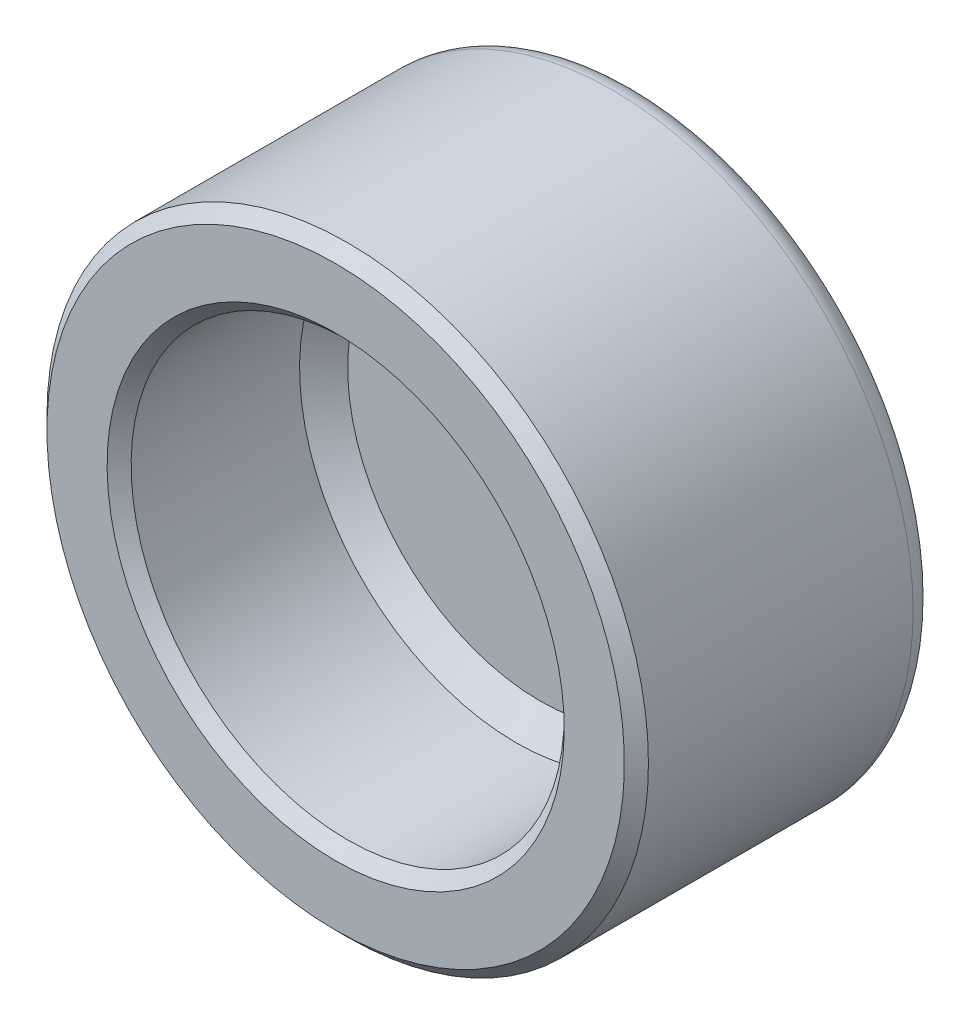
ISO-10303-21;
HEADER;
FILE_DESCRIPTION(('STEP AP214'),'2;1');
FILE_NAME('part.step','',(''),(''),'','','');
FILE_SCHEMA(('AUTOMOTIVE_DESIGN { 1 0 10303 214 1 1 1 1 }'));
ENDSEC;
DATA;
#1=APPLICATION_CONTEXT('core data for automotive mechanical design processes');
#2=APPLICATION_PROTOCOL_DEFINITION('international standard','automotive_design',2000,#1);
#3=PRODUCT_CONTEXT('',#1,'mechanical');
#4=PRODUCT('Part','Part','',(#3));
#5=PRODUCT_RELATED_PRODUCT_CATEGORY('part','',(#4));
#6=PRODUCT_DEFINITION_FORMATION('','',#4);
#7=PRODUCT_DEFINITION_CONTEXT('part definition',#1,'design');
#8=PRODUCT_DEFINITION('design','',#6,#7);
#9=PRODUCT_DEFINITION_SHAPE('','',#8);
#10=(LENGTH_UNIT() NAMED_UNIT(*) SI_UNIT(.MILLI.,.METRE.));
#11=(NAMED_UNIT(*) PLANE_ANGLE_UNIT() SI_UNIT($,.RADIAN.));
#12=(NAMED_UNIT(*) SI_UNIT($,.STERADIAN.) SOLID_ANGLE_UNIT());
#13=UNCERTAINTY_MEASURE_WITH_UNIT(LENGTH_MEASURE(1.E-05),#10,'distance_accuracy_value','');
#14=(GEOMETRIC_REPRESENTATION_CONTEXT(3) GLOBAL_UNCERTAINTY_ASSIGNED_CONTEXT((#13)) GLOBAL_UNIT_ASSIGNED_CONTEXT((#10,
#11,#12)) REPRESENTATION_CONTEXT('',''));
#15=CARTESIAN_POINT('',(0.,0.,0.));
#16=DIRECTION('',(0.,0.,1.));
#17=DIRECTION('',(1.,0.,0.));
#18=AXIS2_PLACEMENT_3D('',#15,#16,#17);
#19=CARTESIAN_POINT('',(100.,100.,1.50000000000002));
#20=DIRECTION('',(0.,0.,-1.));
#21=DIRECTION('',(0.,-1.,0.));
#22=AXIS2_PLACEMENT_3D('',#19,#20,#21);
#23=TOROIDAL_SURFACE('',#22,11.5,1.00000000000002);
#24=CARTESIAN_POINT('',(100.,100.,0.5));
#25=DIRECTION('',(0.,0.,1.));
#26=DIRECTION('',(1.,0.,0.));
#27=AXIS2_PLACEMENT_3D('',#24,#25,#26);
#28=CIRCLE('',#27,11.5);
#29=CARTESIAN_POINT('',(111.5,100.,0.5));
#30=VERTEX_POINT('',#29);
#31=EDGE_CURVE('E10',#30,#30,#28,.T.);
#32=ORIENTED_EDGE('',*,*,#31,.T.);
#33=EDGE_LOOP('',(#32));
#34=FACE_BOUND('',#33,.T.);
#35=CARTESIAN_POINT('',(100.,100.,1.5));
#36=DIRECTION('',(0.,0.,1.));
#37=DIRECTION('',(1.,0.,0.));
#38=AXIS2_PLACEMENT_3D('',#35,#36,#37);
#39=CIRCLE('',#38,12.5);
#40=CARTESIAN_POINT('',(112.5,100.,1.5));
#41=VERTEX_POINT('',#40);
#42=EDGE_CURVE('E27',#41,#41,#39,.T.);
#43=ORIENTED_EDGE('',*,*,#42,.F.);
#44=EDGE_LOOP('',(#43));
#45=FACE_BOUND('',#44,.T.);
#46=ADVANCED_FACE('F14',(#34,#45),#23,.T.);
#47=CARTESIAN_POINT('',(100.,100.,7.));
#48=DIRECTION('',(0.,0.,-1.));
#49=DIRECTION('',(0.,-1.,0.));
#50=AXIS2_PLACEMENT_3D('',#47,#48,#49);
#51=CYLINDRICAL_SURFACE('',#50,12.5);
#52=CARTESIAN_POINT('',(100.,100.,12.5));
#53=DIRECTION('',(0.,0.,-1.));
#54=DIRECTION('',(0.,-1.,0.));
#55=AXIS2_PLACEMENT_3D('',#52,#53,#54);
#56=CIRCLE('',#55,12.5);
#57=CARTESIAN_POINT('',(100.,87.5,12.5));
#58=VERTEX_POINT('',#57);
#59=EDGE_CURVE('E22',#58,#58,#56,.T.);
#60=ORIENTED_EDGE('',*,*,#59,.T.);
#61=EDGE_LOOP('',(#60));
#62=FACE_BOUND('',#61,.T.);
#63=ORIENTED_EDGE('',*,*,#42,.T.);
#64=EDGE_LOOP('',(#63));
#65=FACE_BOUND('',#64,.T.);
#66=ADVANCED_FACE('F72',(#62,#65),#51,.T.);
#67=CARTESIAN_POINT('',(100.,100.,12.5));
#68=DIRECTION('',(0.,0.,-1.));
#69=DIRECTION('',(0.,-1.,0.));
#70=AXIS2_PLACEMENT_3D('',#67,#68,#69);
#71=CONICAL_SURFACE('',#70,12.5,0.785398163397447);
#72=CARTESIAN_POINT('',(100.,100.,13.));
#73=DIRECTION('',(0.,0.,-1.));
#74=DIRECTION('',(0.,-1.,0.));
#75=AXIS2_PLACEMENT_3D('',#72,#73,#74);
#76=CIRCLE('',#75,12.);
#77=CARTESIAN_POINT('',(100.,88.,13.));
#78=VERTEX_POINT('',#77);
#79=EDGE_CURVE('E31',#78,#78,#76,.T.);
#80=ORIENTED_EDGE('',*,*,#79,.T.);
#81=EDGE_LOOP('',(#80));
#82=FACE_BOUND('',#81,.T.);
#83=ORIENTED_EDGE('',*,*,#59,.F.);
#84=EDGE_LOOP('',(#83));
#85=FACE_BOUND('',#84,.T.);
#86=ADVANCED_FACE('F16',(#82,#85),#71,.T.);
#87=CARTESIAN_POINT('',(100.,100.,0.50000000004502));
#88=DIRECTION('',(0.,0.,1.));
#89=DIRECTION('',(1.,0.,0.));
#90=AXIS2_PLACEMENT_3D('',#87,#88,#89);
#91=CONICAL_SURFACE('',#90,2.74999999996908,0.785398163340605);
#92=CARTESIAN_POINT('',(100.,100.,0.));
#93=DIRECTION('',(0.,0.,1.));
#94=DIRECTION('',(1.,0.,0.));
#95=AXIS2_PLACEMENT_3D('',#92,#93,#94);
#96=CIRCLE('',#95,2.24999999998091);
#97=CARTESIAN_POINT('',(102.249999999981,100.,0.));
#98=VERTEX_POINT('',#97);
#99=EDGE_CURVE('E35',#98,#98,#96,.T.);
#100=ORIENTED_EDGE('',*,*,#99,.T.);
#101=EDGE_LOOP('',(#100));
#102=FACE_BOUND('',#101,.T.);
#103=CARTESIAN_POINT('',(100.,100.,0.50000000004502));
#104=DIRECTION('',(0.,0.,1.));
#105=DIRECTION('',(1.,0.,0.));
#106=AXIS2_PLACEMENT_3D('',#103,#104,#105);
#107=CIRCLE('',#106,2.74999999996908);
#108=CARTESIAN_POINT('',(102.749999999969,100.,0.50000000004502));
#109=VERTEX_POINT('',#108);
#110=EDGE_CURVE('E39',#109,#109,#107,.T.);
#111=ORIENTED_EDGE('',*,*,#110,.F.);
#112=EDGE_LOOP('',(#111));
#113=FACE_BOUND('',#112,.T.);
#114=ADVANCED_FACE('F84',(#102,#113),#91,.T.);
#115=CARTESIAN_POINT('',(100.,100.,12.5));
#116=DIRECTION('',(0.,0.,1.));
#117=DIRECTION('',(1.,0.,0.));
#118=AXIS2_PLACEMENT_3D('',#115,#116,#117);
#119=CONICAL_SURFACE('',#118,8.99999999999999,0.785398163397443);
#120=CARTESIAN_POINT('',(100.,100.,12.5));
#121=DIRECTION('',(0.,0.,-1.));
#122=DIRECTION('',(0.,-1.,0.));
#123=AXIS2_PLACEMENT_3D('',#120,#121,#122);
#124=CIRCLE('',#123,8.99999999999999);
#125=CARTESIAN_POINT('',(100.,91.,12.5));
#126=VERTEX_POINT('',#125);
#127=EDGE_CURVE('E38',#126,#126,#124,.T.);
#128=ORIENTED_EDGE('',*,*,#127,.T.);
#129=EDGE_LOOP('',(#128));
#130=FACE_BOUND('',#129,.T.);
#131=CARTESIAN_POINT('',(100.,100.,13.));
#132=DIRECTION('',(0.,0.,-1.));
#133=DIRECTION('',(0.,-1.,0.));
#134=AXIS2_PLACEMENT_3D('',#131,#132,#133);
#135=CIRCLE('',#134,9.49999999999999);
#136=CARTESIAN_POINT('',(100.,90.5,13.));
#137=VERTEX_POINT('',#136);
#138=EDGE_CURVE('E42',#137,#137,#135,.T.);
#139=ORIENTED_EDGE('',*,*,#138,.F.);
#140=EDGE_LOOP('',(#139));
#141=FACE_BOUND('',#140,.T.);
#142=ADVANCED_FACE('F90',(#130,#141),#119,.F.);
#143=CARTESIAN_POINT('',(100.,100.,12.5));
#144=DIRECTION('',(0.,0.,-1.));
#145=DIRECTION('',(0.,-1.,0.));
#146=AXIS2_PLACEMENT_3D('',#143,#144,#145);
#147=CYLINDRICAL_SURFACE('',#146,9.00000000000001);
#148=ORIENTED_EDGE('',*,*,#127,.F.);
#149=EDGE_LOOP('',(#148));
#150=FACE_BOUND('',#149,.T.);
#151=CARTESIAN_POINT('',(100.,100.,5.5));
#152=DIRECTION('',(0.,0.,-1.));
#153=DIRECTION('',(0.,-1.,0.));
#154=AXIS2_PLACEMENT_3D('',#151,#152,#153);
#155=CIRCLE('',#154,9.00000000000001);
#156=CARTESIAN_POINT('',(100.,91.,5.5));
#157=VERTEX_POINT('',#156);
#158=EDGE_CURVE('E45',#157,#157,#155,.T.);
#159=ORIENTED_EDGE('',*,*,#158,.T.);
#160=EDGE_LOOP('',(#159));
#161=FACE_BOUND('',#160,.T.);
#162=ADVANCED_FACE('F68',(#150,#161),#147,.F.);
#163=CARTESIAN_POINT('',(100.,100.,4.49999999999998));
#164=DIRECTION('',(0.,0.,1.));
#165=DIRECTION('',(1.,0.,0.));
#166=AXIS2_PLACEMENT_3D('',#163,#164,#165);
#167=CONICAL_SURFACE('',#166,7.99999999999999,0.785398163397447);
#168=CARTESIAN_POINT('',(100.,100.,4.49999999999999));
#169=DIRECTION('',(0.,0.,-1.));
#170=DIRECTION('',(0.,-1.,0.));
#171=AXIS2_PLACEMENT_3D('',#168,#169,#170);
#172=CIRCLE('',#171,8.00000000000001);
#173=CARTESIAN_POINT('',(100.,92.,4.49999999999999));
#174=VERTEX_POINT('',#173);
#175=EDGE_CURVE('E18',#174,#174,#172,.T.);
#176=ORIENTED_EDGE('',*,*,#175,.T.);
#177=EDGE_LOOP('',(#176));
#178=FACE_BOUND('',#177,.T.);
#179=ORIENTED_EDGE('',*,*,#158,.F.);
#180=EDGE_LOOP('',(#179));
#181=FACE_BOUND('',#180,.T.);
#182=ADVANCED_FACE('F53',(#178,#181),#167,.F.);
#183=CARTESIAN_POINT('',(96.,100.,4.5));
#184=DIRECTION('',(0.,0.,1.));
#185=DIRECTION('',(1.,0.,0.));
#186=AXIS2_PLACEMENT_3D('',#183,#184,#185);
#187=PLANE('',#186);
#188=ORIENTED_EDGE('',*,*,#175,.F.);
#189=EDGE_LOOP('',(#188));
#190=FACE_BOUND('',#189,.T.);
#191=ADVANCED_FACE('F56',(#190),#187,.T.);
#192=CARTESIAN_POINT('',(98.875,100.,0.));
#193=DIRECTION('',(0.,0.,-1.));
#194=DIRECTION('',(-1.,0.,0.));
#195=AXIS2_PLACEMENT_3D('',#192,#193,#194);
#196=PLANE('',#195);
#197=ORIENTED_EDGE('',*,*,#99,.F.);
#198=EDGE_LOOP('',(#197));
#199=FACE_BOUND('',#198,.T.);
#200=ADVANCED_FACE('F58',(#199),#196,.T.);
#201=CARTESIAN_POINT('',(89.25,100.,13.));
#202=DIRECTION('',(0.,0.,1.));
#203=DIRECTION('',(1.,0.,0.));
#204=AXIS2_PLACEMENT_3D('',#201,#202,#203);
#205=PLANE('',#204);
#206=ORIENTED_EDGE('',*,*,#79,.F.);
#207=EDGE_LOOP('',(#206));
#208=FACE_BOUND('',#207,.T.);
#209=ORIENTED_EDGE('',*,*,#138,.T.);
#210=EDGE_LOOP('',(#209));
#211=FACE_BOUND('',#210,.T.);
#212=ADVANCED_FACE('F65',(#208,#211),#205,.T.);
#213=CARTESIAN_POINT('',(92.875,100.,0.5));
#214=DIRECTION('',(0.,0.,-1.));
#215=DIRECTION('',(-1.,0.,0.));
#216=AXIS2_PLACEMENT_3D('',#213,#214,#215);
#217=PLANE('',#216);
#218=ORIENTED_EDGE('',*,*,#31,.F.);
#219=EDGE_LOOP('',(#218));
#220=FACE_BOUND('',#219,.T.);
#221=ORIENTED_EDGE('',*,*,#110,.T.);
#222=EDGE_LOOP('',(#221));
#223=FACE_BOUND('',#222,.T.);
#224=ADVANCED_FACE('F103',(#220,#223),#217,.T.);
#225=CLOSED_SHELL('',(#46,#66,#86,#114,#142,#162,#182,#191,#200,#212,#224));
#226=MANIFOLD_SOLID_BREP('B1',#225);
#227=ADVANCED_BREP_SHAPE_REPRESENTATION('',(#18,#226),#14);
#228=SHAPE_DEFINITION_REPRESENTATION(#9,#227);
ENDSEC;
END-ISO-10303-21;
